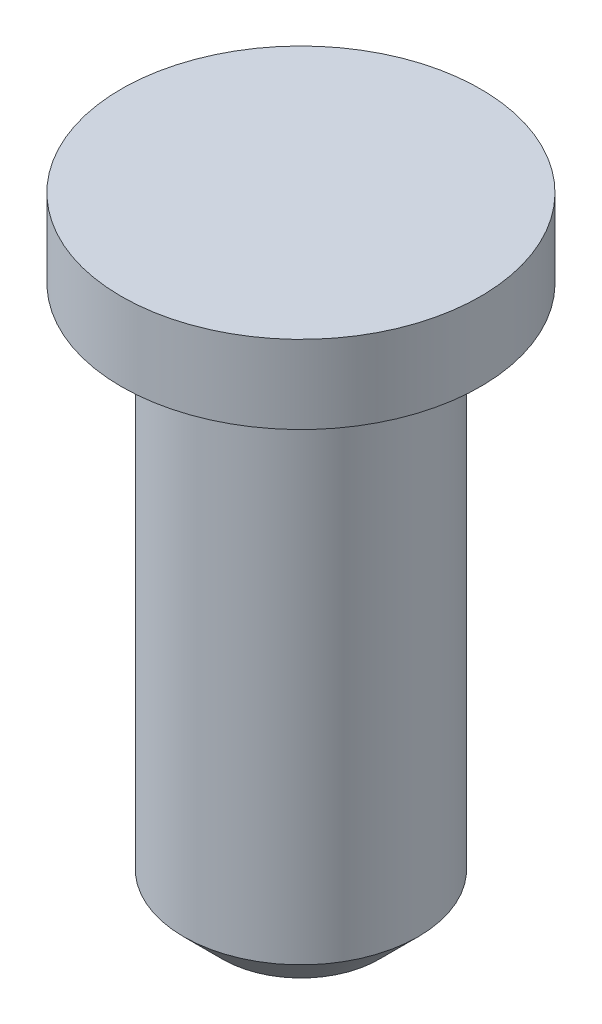
ISO-10303-21;
HEADER;
FILE_DESCRIPTION(('STEP AP214'),'2;1');
FILE_NAME('part.step','',(''),(''),'','','');
FILE_SCHEMA(('AUTOMOTIVE_DESIGN { 1 0 10303 214 1 1 1 1 }'));
ENDSEC;
DATA;
#1=APPLICATION_CONTEXT('core data for automotive mechanical design processes');
#2=APPLICATION_PROTOCOL_DEFINITION('international standard','automotive_design',2000,#1);
#3=PRODUCT_CONTEXT('',#1,'mechanical');
#4=PRODUCT('Part','Part','',(#3));
#5=PRODUCT_RELATED_PRODUCT_CATEGORY('part','',(#4));
#6=PRODUCT_DEFINITION_FORMATION('','',#4);
#7=PRODUCT_DEFINITION_CONTEXT('part definition',#1,'design');
#8=PRODUCT_DEFINITION('design','',#6,#7);
#9=PRODUCT_DEFINITION_SHAPE('','',#8);
#10=(LENGTH_UNIT() NAMED_UNIT(*) SI_UNIT(.MILLI.,.METRE.));
#11=(NAMED_UNIT(*) PLANE_ANGLE_UNIT() SI_UNIT($,.RADIAN.));
#12=(NAMED_UNIT(*) SI_UNIT($,.STERADIAN.) SOLID_ANGLE_UNIT());
#13=UNCERTAINTY_MEASURE_WITH_UNIT(LENGTH_MEASURE(1.E-05),#10,'distance_accuracy_value','');
#14=(GEOMETRIC_REPRESENTATION_CONTEXT(3) GLOBAL_UNCERTAINTY_ASSIGNED_CONTEXT((#13)) GLOBAL_UNIT_ASSIGNED_CONTEXT((#10,
#11,#12)) REPRESENTATION_CONTEXT('',''));
#15=CARTESIAN_POINT('',(0.,0.,0.));
#16=DIRECTION('',(0.,0.,1.));
#17=DIRECTION('',(1.,0.,0.));
#18=AXIS2_PLACEMENT_3D('',#15,#16,#17);
#19=CARTESIAN_POINT('',(0.,0.,0.));
#20=DIRECTION('',(0.,-1.,0.));
#21=DIRECTION('',(0.,0.,-1.));
#22=AXIS2_PLACEMENT_3D('',#19,#20,#21);
#23=PLANE('',#22);
#24=CARTESIAN_POINT('',(0.,0.,0.));
#25=DIRECTION('',(0.,1.,0.));
#26=DIRECTION('',(0.,0.,1.));
#27=AXIS2_PLACEMENT_3D('',#24,#25,#26);
#28=CIRCLE('',#27,2.3);
#29=CARTESIAN_POINT('',(0.,0.,2.3));
#30=VERTEX_POINT('',#29);
#31=EDGE_CURVE('E43',#30,#30,#28,.T.);
#32=ORIENTED_EDGE('',*,*,#31,.T.);
#33=EDGE_LOOP('',(#32));
#34=FACE_BOUND('',#33,.T.);
#35=ADVANCED_FACE('F32',(#34),#23,.F.);
#36=CARTESIAN_POINT('',(0.,0.,0.));
#37=DIRECTION('',(0.,1.,0.));
#38=DIRECTION('',(0.,0.,1.));
#39=AXIS2_PLACEMENT_3D('',#36,#37,#38);
#40=CYLINDRICAL_SURFACE('',#39,2.3);
#41=ORIENTED_EDGE('',*,*,#31,.F.);
#42=EDGE_LOOP('',(#41));
#43=FACE_BOUND('',#42,.T.);
#44=CARTESIAN_POINT('',(0.,-1.,0.));
#45=DIRECTION('',(0.,1.,0.));
#46=DIRECTION('',(0.,0.,1.));
#47=AXIS2_PLACEMENT_3D('',#44,#45,#46);
#48=CIRCLE('',#47,2.3);
#49=CARTESIAN_POINT('',(0.,-1.,2.3));
#50=VERTEX_POINT('',#49);
#51=EDGE_CURVE('E47',#50,#50,#48,.T.);
#52=ORIENTED_EDGE('',*,*,#51,.T.);
#53=EDGE_LOOP('',(#52));
#54=FACE_BOUND('',#53,.T.);
#55=ADVANCED_FACE('F67',(#43,#54),#40,.T.);
#56=CARTESIAN_POINT('',(2.3,-1.,0.));
#57=DIRECTION('',(0.,1.,0.));
#58=DIRECTION('',(0.,0.,1.));
#59=AXIS2_PLACEMENT_3D('',#56,#57,#58);
#60=PLANE('',#59);
#61=ORIENTED_EDGE('',*,*,#51,.F.);
#62=EDGE_LOOP('',(#61));
#63=FACE_BOUND('',#62,.T.);
#64=CARTESIAN_POINT('',(0.,-1.,0.));
#65=DIRECTION('',(0.,1.,0.));
#66=DIRECTION('',(0.,0.,1.));
#67=AXIS2_PLACEMENT_3D('',#64,#65,#66);
#68=CIRCLE('',#67,1.5);
#69=CARTESIAN_POINT('',(0.,-1.,1.5));
#70=VERTEX_POINT('',#69);
#71=EDGE_CURVE('E52',#70,#70,#68,.T.);
#72=ORIENTED_EDGE('',*,*,#71,.T.);
#73=EDGE_LOOP('',(#72));
#74=FACE_BOUND('',#73,.T.);
#75=ADVANCED_FACE('F56',(#63,#74),#60,.F.);
#76=CARTESIAN_POINT('',(0.,0.,0.));
#77=DIRECTION('',(0.,1.,0.));
#78=DIRECTION('',(0.,0.,1.));
#79=AXIS2_PLACEMENT_3D('',#76,#77,#78);
#80=CYLINDRICAL_SURFACE('',#79,1.5);
#81=CARTESIAN_POINT('',(0.,-7.5,0.));
#82=DIRECTION('',(0.,1.,0.));
#83=DIRECTION('',(0.,0.,1.));
#84=AXIS2_PLACEMENT_3D('',#81,#82,#83);
#85=CIRCLE('',#84,1.5);
#86=CARTESIAN_POINT('',(0.,-7.5,1.5));
#87=VERTEX_POINT('',#86);
#88=EDGE_CURVE('E39',#87,#87,#85,.T.);
#89=ORIENTED_EDGE('',*,*,#88,.T.);
#90=EDGE_LOOP('',(#89));
#91=FACE_BOUND('',#90,.T.);
#92=ORIENTED_EDGE('',*,*,#71,.F.);
#93=EDGE_LOOP('',(#92));
#94=FACE_BOUND('',#93,.T.);
#95=ADVANCED_FACE('F58',(#91,#94),#80,.T.);
#96=CARTESIAN_POINT('',(1.5,-8.,0.));
#97=DIRECTION('',(0.,1.,0.));
#98=DIRECTION('',(0.,0.,1.));
#99=AXIS2_PLACEMENT_3D('',#96,#97,#98);
#100=PLANE('',#99);
#101=CARTESIAN_POINT('',(0.,-8.,0.));
#102=DIRECTION('',(0.,1.,0.));
#103=DIRECTION('',(0.,0.,1.));
#104=AXIS2_PLACEMENT_3D('',#101,#102,#103);
#105=CIRCLE('',#104,1.);
#106=CARTESIAN_POINT('',(0.,-8.,1.));
#107=VERTEX_POINT('',#106);
#108=EDGE_CURVE('E10',#107,#107,#105,.F.);
#109=ORIENTED_EDGE('',*,*,#108,.T.);
#110=EDGE_LOOP('',(#109));
#111=FACE_BOUND('',#110,.T.);
#112=ADVANCED_FACE('F60',(#111),#100,.F.);
#113=CARTESIAN_POINT('',(0.,-7.5,0.));
#114=DIRECTION('',(0.,1.,0.));
#115=DIRECTION('',(0.,0.,1.));
#116=AXIS2_PLACEMENT_3D('',#113,#114,#115);
#117=CONICAL_SURFACE('',#116,1.5,0.78539816339745);
#118=ORIENTED_EDGE('',*,*,#108,.F.);
#119=EDGE_LOOP('',(#118));
#120=FACE_BOUND('',#119,.T.);
#121=ORIENTED_EDGE('',*,*,#88,.F.);
#122=EDGE_LOOP('',(#121));
#123=FACE_BOUND('',#122,.T.);
#124=ADVANCED_FACE('F34',(#120,#123),#117,.T.);
#125=CLOSED_SHELL('',(#35,#55,#75,#95,#112,#124));
#126=MANIFOLD_SOLID_BREP('B2',#125);
#127=ADVANCED_BREP_SHAPE_REPRESENTATION('',(#18,#126),#14);
#128=SHAPE_DEFINITION_REPRESENTATION(#9,#127);
ENDSEC;
END-ISO-10303-21;
